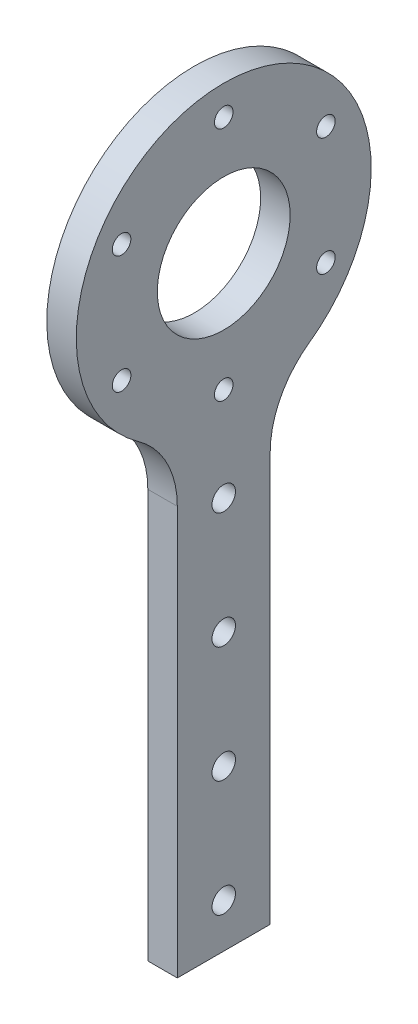
ISO-10303-21;
HEADER;
FILE_DESCRIPTION(('STEP AP214'),'2;1');
FILE_NAME('part.step','',(''),(''),'','','');
FILE_SCHEMA(('AUTOMOTIVE_DESIGN { 1 0 10303 214 1 1 1 1 }'));
ENDSEC;
DATA;
#1=APPLICATION_CONTEXT('core data for automotive mechanical design processes');
#2=APPLICATION_PROTOCOL_DEFINITION('international standard','automotive_design',2000,#1);
#3=PRODUCT_CONTEXT('',#1,'mechanical');
#4=PRODUCT('Part','Part','',(#3));
#5=PRODUCT_RELATED_PRODUCT_CATEGORY('part','',(#4));
#6=PRODUCT_DEFINITION_FORMATION('','',#4);
#7=PRODUCT_DEFINITION_CONTEXT('part definition',#1,'design');
#8=PRODUCT_DEFINITION('design','',#6,#7);
#9=PRODUCT_DEFINITION_SHAPE('','',#8);
#10=(LENGTH_UNIT() NAMED_UNIT(*) SI_UNIT(.MILLI.,.METRE.));
#11=(NAMED_UNIT(*) PLANE_ANGLE_UNIT() SI_UNIT($,.RADIAN.));
#12=(NAMED_UNIT(*) SI_UNIT($,.STERADIAN.) SOLID_ANGLE_UNIT());
#13=UNCERTAINTY_MEASURE_WITH_UNIT(LENGTH_MEASURE(1.E-05),#10,'distance_accuracy_value','');
#14=(GEOMETRIC_REPRESENTATION_CONTEXT(3) GLOBAL_UNCERTAINTY_ASSIGNED_CONTEXT((#13)) GLOBAL_UNIT_ASSIGNED_CONTEXT((#10,
#11,#12)) REPRESENTATION_CONTEXT('',''));
#15=CARTESIAN_POINT('',(0.,0.,0.));
#16=DIRECTION('',(0.,0.,1.));
#17=DIRECTION('',(1.,0.,0.));
#18=AXIS2_PLACEMENT_3D('',#15,#16,#17);
#19=CARTESIAN_POINT('',(6.35,0.,0.));
#20=DIRECTION('',(-1.,0.,0.));
#21=DIRECTION('',(0.,0.,1.));
#22=AXIS2_PLACEMENT_3D('',#19,#20,#21);
#23=CYLINDRICAL_SURFACE('',#22,31.75);
#24=CARTESIAN_POINT('',(6.35,0.,0.));
#25=DIRECTION('',(1.,0.,0.));
#26=DIRECTION('',(0.,0.,-1.));
#27=AXIS2_PLACEMENT_3D('',#24,#25,#26);
#28=CIRCLE('',#27,31.75);
#29=CARTESIAN_POINT('',(6.35,-25.8706229739502,-18.4057971014493));
#30=VERTEX_POINT('',#29);
#31=CARTESIAN_POINT('',(6.35,-25.8706229739502,18.4057971014493));
#32=VERTEX_POINT('',#31);
#33=EDGE_CURVE('E98',#30,#32,#28,.T.);
#34=ORIENTED_EDGE('',*,*,#33,.F.);
#35=DIRECTION('',(-1.,0.,0.));
#36=VECTOR('',#35,1.);
#37=CARTESIAN_POINT('',(6.35,-25.8706229739502,-18.4057971014493));
#38=LINE('',#37,#36);
#39=CARTESIAN_POINT('',(0.,-25.8706229739502,-18.4057971014493));
#40=VERTEX_POINT('',#39);
#41=EDGE_CURVE('E130',#30,#40,#38,.T.);
#42=ORIENTED_EDGE('',*,*,#41,.T.);
#43=CARTESIAN_POINT('',(0.,0.,0.));
#44=DIRECTION('',(1.,0.,0.));
#45=DIRECTION('',(0.,0.,-1.));
#46=AXIS2_PLACEMENT_3D('',#43,#44,#45);
#47=CIRCLE('',#46,31.75);
#48=CARTESIAN_POINT('',(0.,-25.8706229739502,18.4057971014493));
#49=VERTEX_POINT('',#48);
#50=EDGE_CURVE('E118',#40,#49,#47,.T.);
#51=ORIENTED_EDGE('',*,*,#50,.T.);
#52=DIRECTION('',(-1.,0.,0.));
#53=VECTOR('',#52,1.);
#54=CARTESIAN_POINT('',(6.35,-25.8706229739502,18.4057971014493));
#55=LINE('',#54,#53);
#56=EDGE_CURVE('E107',#49,#32,#55,.F.);
#57=ORIENTED_EDGE('',*,*,#56,.T.);
#58=EDGE_LOOP('',(#34,#42,#51,#57));
#59=FACE_BOUND('',#58,.T.);
#60=ADVANCED_FACE('F41',(#59),#23,.T.);
#61=CARTESIAN_POINT('',(6.35,0.,10.));
#62=DIRECTION('',(0.,0.,-1.));
#63=DIRECTION('',(0.,1.,0.));
#64=AXIS2_PLACEMENT_3D('',#61,#62,#63);
#65=PLANE('',#64);
#66=DIRECTION('',(0.,-1.,0.));
#67=VECTOR('',#66,1.);
#68=CARTESIAN_POINT('',(6.35,0.,10.));
#69=LINE('',#68,#67);
#70=CARTESIAN_POINT('',(6.35,-42.1670783906118,10.));
#71=VERTEX_POINT('',#70);
#72=CARTESIAN_POINT('',(6.35,-130.134075396468,9.99999999999999));
#73=VERTEX_POINT('',#72);
#74=EDGE_CURVE('E90',#71,#73,#69,.T.);
#75=ORIENTED_EDGE('',*,*,#74,.F.);
#76=DIRECTION('',(1.,0.,0.));
#77=VECTOR('',#76,1.);
#78=CARTESIAN_POINT('',(0.,-42.1670783906118,10.));
#79=LINE('',#78,#77);
#80=CARTESIAN_POINT('',(0.,-42.1670783906118,10.));
#81=VERTEX_POINT('',#80);
#82=EDGE_CURVE('E135',#71,#81,#79,.F.);
#83=ORIENTED_EDGE('',*,*,#82,.T.);
#84=DIRECTION('',(0.,-1.,0.));
#85=VECTOR('',#84,1.);
#86=CARTESIAN_POINT('',(0.,0.,10.));
#87=LINE('',#86,#85);
#88=CARTESIAN_POINT('',(0.,-130.134075396468,9.99999999999999));
#89=VERTEX_POINT('',#88);
#90=EDGE_CURVE('E104',#81,#89,#87,.T.);
#91=ORIENTED_EDGE('',*,*,#90,.T.);
#92=DIRECTION('',(-1.,0.,0.));
#93=VECTOR('',#92,1.);
#94=CARTESIAN_POINT('',(6.35,-130.134075396468,9.99999999999999));
#95=LINE('',#94,#93);
#96=EDGE_CURVE('E101',#73,#89,#95,.T.);
#97=ORIENTED_EDGE('',*,*,#96,.F.);
#98=EDGE_LOOP('',(#75,#83,#91,#97));
#99=FACE_BOUND('',#98,.T.);
#100=ADVANCED_FACE('F102',(#99),#65,.F.);
#101=CARTESIAN_POINT('',(6.35,-130.134075396468,0.));
#102=DIRECTION('',(0.,1.,0.));
#103=DIRECTION('',(0.,0.,1.));
#104=AXIS2_PLACEMENT_3D('',#101,#102,#103);
#105=PLANE('',#104);
#106=DIRECTION('',(0.,0.,-1.));
#107=VECTOR('',#106,1.);
#108=CARTESIAN_POINT('',(0.,-130.134075396468,0.));
#109=LINE('',#108,#107);
#110=CARTESIAN_POINT('',(0.,-130.134075396468,-9.99999999999999));
#111=VERTEX_POINT('',#110);
#112=EDGE_CURVE('E123',#89,#111,#109,.T.);
#113=ORIENTED_EDGE('',*,*,#112,.T.);
#114=DIRECTION('',(-1.,0.,0.));
#115=VECTOR('',#114,1.);
#116=CARTESIAN_POINT('',(6.35,-130.134075396468,-9.99999999999999));
#117=LINE('',#116,#115);
#118=CARTESIAN_POINT('',(6.35,-130.134075396468,-9.99999999999999));
#119=VERTEX_POINT('',#118);
#120=EDGE_CURVE('E108',#119,#111,#117,.T.);
#121=ORIENTED_EDGE('',*,*,#120,.F.);
#122=DIRECTION('',(0.,0.,-1.));
#123=VECTOR('',#122,1.);
#124=CARTESIAN_POINT('',(6.35,-130.134075396468,0.));
#125=LINE('',#124,#123);
#126=EDGE_CURVE('E95',#73,#119,#125,.T.);
#127=ORIENTED_EDGE('',*,*,#126,.F.);
#128=ORIENTED_EDGE('',*,*,#96,.T.);
#129=EDGE_LOOP('',(#113,#121,#127,#128));
#130=FACE_BOUND('',#129,.T.);
#131=ADVANCED_FACE('F110',(#130),#105,.F.);
#132=CARTESIAN_POINT('',(6.35,0.,-10.));
#133=DIRECTION('',(0.,0.,1.));
#134=DIRECTION('',(0.,-1.,0.));
#135=AXIS2_PLACEMENT_3D('',#132,#133,#134);
#136=PLANE('',#135);
#137=DIRECTION('',(0.,1.,0.));
#138=VECTOR('',#137,1.);
#139=CARTESIAN_POINT('',(0.,0.,-10.));
#140=LINE('',#139,#138);
#141=CARTESIAN_POINT('',(0.,-42.1670783906118,-10.));
#142=VERTEX_POINT('',#141);
#143=EDGE_CURVE('E125',#111,#142,#140,.T.);
#144=ORIENTED_EDGE('',*,*,#143,.T.);
#145=DIRECTION('',(1.,0.,0.));
#146=VECTOR('',#145,1.);
#147=CARTESIAN_POINT('',(6.35,-42.1670783906118,-10.));
#148=LINE('',#147,#146);
#149=CARTESIAN_POINT('',(6.35,-42.1670783906118,-10.));
#150=VERTEX_POINT('',#149);
#151=EDGE_CURVE('E133',#142,#150,#148,.T.);
#152=ORIENTED_EDGE('',*,*,#151,.T.);
#153=DIRECTION('',(0.,1.,0.));
#154=VECTOR('',#153,1.);
#155=CARTESIAN_POINT('',(6.35,0.,-10.));
#156=LINE('',#155,#154);
#157=EDGE_CURVE('E113',#119,#150,#156,.T.);
#158=ORIENTED_EDGE('',*,*,#157,.F.);
#159=ORIENTED_EDGE('',*,*,#120,.T.);
#160=EDGE_LOOP('',(#144,#152,#158,#159));
#161=FACE_BOUND('',#160,.T.);
#162=ADVANCED_FACE('F166',(#161),#136,.F.);
#163=CARTESIAN_POINT('',(6.35,0.,0.));
#164=DIRECTION('',(1.,0.,0.));
#165=DIRECTION('',(0.,0.,-1.));
#166=AXIS2_PLACEMENT_3D('',#163,#164,#165);
#167=PLANE('',#166);
#168=CARTESIAN_POINT('',(6.35,-120.636624279953,0.));
#169=DIRECTION('',(1.,0.,0.));
#170=DIRECTION('',(0.,0.,-1.));
#171=AXIS2_PLACEMENT_3D('',#168,#169,#170);
#172=CIRCLE('',#171,2.525);
#173=CARTESIAN_POINT('',(6.35,-120.636624279953,-2.525));
#174=VERTEX_POINT('',#173);
#175=EDGE_CURVE('E222',#174,#174,#172,.T.);
#176=ORIENTED_EDGE('',*,*,#175,.F.);
#177=EDGE_LOOP('',(#176));
#178=FACE_BOUND('',#177,.T.);
#179=CARTESIAN_POINT('',(6.35,-95.6366242799533,0.));
#180=DIRECTION('',(1.,0.,0.));
#181=DIRECTION('',(0.,0.,-1.));
#182=AXIS2_PLACEMENT_3D('',#179,#180,#181);
#183=CIRCLE('',#182,2.525);
#184=CARTESIAN_POINT('',(6.35,-95.6366242799533,-2.525));
#185=VERTEX_POINT('',#184);
#186=EDGE_CURVE('E223',#185,#185,#183,.T.);
#187=ORIENTED_EDGE('',*,*,#186,.F.);
#188=EDGE_LOOP('',(#187));
#189=FACE_BOUND('',#188,.T.);
#190=CARTESIAN_POINT('',(6.35,-70.6366242799533,0.));
#191=DIRECTION('',(1.,0.,0.));
#192=DIRECTION('',(0.,0.,-1.));
#193=AXIS2_PLACEMENT_3D('',#190,#191,#192);
#194=CIRCLE('',#193,2.525);
#195=CARTESIAN_POINT('',(6.35,-70.6366242799533,-2.525));
#196=VERTEX_POINT('',#195);
#197=EDGE_CURVE('E233',#196,#196,#194,.T.);
#198=ORIENTED_EDGE('',*,*,#197,.F.);
#199=EDGE_LOOP('',(#198));
#200=FACE_BOUND('',#199,.T.);
#201=CARTESIAN_POINT('',(6.35,-45.6366242799533,0.));
#202=DIRECTION('',(1.,0.,0.));
#203=DIRECTION('',(0.,0.,-1.));
#204=AXIS2_PLACEMENT_3D('',#201,#202,#203);
#205=CIRCLE('',#204,2.525);
#206=CARTESIAN_POINT('',(6.35,-45.6366242799533,-2.525));
#207=VERTEX_POINT('',#206);
#208=EDGE_CURVE('E239',#207,#207,#205,.T.);
#209=ORIENTED_EDGE('',*,*,#208,.F.);
#210=EDGE_LOOP('',(#209));
#211=FACE_BOUND('',#210,.T.);
#212=CARTESIAN_POINT('',(6.35,12.7000000000003,21.9970452561246));
#213=DIRECTION('',(1.,0.,0.));
#214=DIRECTION('',(0.,0.,-1.));
#215=AXIS2_PLACEMENT_3D('',#212,#213,#214);
#216=CIRCLE('',#215,2.);
#217=CARTESIAN_POINT('',(6.35,12.7000000000003,19.9970452561246));
#218=VERTEX_POINT('',#217);
#219=EDGE_CURVE('E276',#218,#218,#216,.T.);
#220=ORIENTED_EDGE('',*,*,#219,.F.);
#221=EDGE_LOOP('',(#220));
#222=FACE_BOUND('',#221,.T.);
#223=CARTESIAN_POINT('',(6.35,-12.6999999999998,21.9970452561249));
#224=DIRECTION('',(1.,0.,0.));
#225=DIRECTION('',(0.,0.,-1.));
#226=AXIS2_PLACEMENT_3D('',#223,#224,#225);
#227=CIRCLE('',#226,2.);
#228=CARTESIAN_POINT('',(6.35,-12.6999999999998,19.9970452561249));
#229=VERTEX_POINT('',#228);
#230=EDGE_CURVE('E270',#229,#229,#227,.T.);
#231=ORIENTED_EDGE('',*,*,#230,.F.);
#232=EDGE_LOOP('',(#231));
#233=FACE_BOUND('',#232,.T.);
#234=CARTESIAN_POINT('',(6.35,-25.4,1.77367252013231E-13));
#235=DIRECTION('',(1.,0.,0.));
#236=DIRECTION('',(0.,0.,-1.));
#237=AXIS2_PLACEMENT_3D('',#234,#235,#236);
#238=CIRCLE('',#237,2.);
#239=CARTESIAN_POINT('',(6.35,-25.4,-1.99999999999982));
#240=VERTEX_POINT('',#239);
#241=EDGE_CURVE('E264',#240,#240,#238,.T.);
#242=ORIENTED_EDGE('',*,*,#241,.F.);
#243=EDGE_LOOP('',(#242));
#244=FACE_BOUND('',#243,.T.);
#245=CARTESIAN_POINT('',(6.35,-12.7000000000001,-21.9970452561247));
#246=DIRECTION('',(1.,0.,0.));
#247=DIRECTION('',(0.,0.,-1.));
#248=AXIS2_PLACEMENT_3D('',#245,#246,#247);
#249=CIRCLE('',#248,2.);
#250=CARTESIAN_POINT('',(6.35,-12.7000000000001,-23.9970452561247));
#251=VERTEX_POINT('',#250);
#252=EDGE_CURVE('E258',#251,#251,#249,.T.);
#253=ORIENTED_EDGE('',*,*,#252,.F.);
#254=EDGE_LOOP('',(#253));
#255=FACE_BOUND('',#254,.T.);
#256=CARTESIAN_POINT('',(6.35,12.6999999999999,-21.9970452561248));
#257=DIRECTION('',(1.,0.,0.));
#258=DIRECTION('',(0.,0.,-1.));
#259=AXIS2_PLACEMENT_3D('',#256,#257,#258);
#260=CIRCLE('',#259,2.);
#261=CARTESIAN_POINT('',(6.35,12.6999999999999,-23.9970452561248));
#262=VERTEX_POINT('',#261);
#263=EDGE_CURVE('E252',#262,#262,#260,.T.);
#264=ORIENTED_EDGE('',*,*,#263,.F.);
#265=EDGE_LOOP('',(#264));
#266=FACE_BOUND('',#265,.T.);
#267=CARTESIAN_POINT('',(6.35,25.4,0.));
#268=DIRECTION('',(1.,0.,0.));
#269=DIRECTION('',(0.,0.,-1.));
#270=AXIS2_PLACEMENT_3D('',#267,#268,#269);
#271=CIRCLE('',#270,2.);
#272=CARTESIAN_POINT('',(6.35,25.4,-2.));
#273=VERTEX_POINT('',#272);
#274=EDGE_CURVE('E245',#273,#273,#271,.T.);
#275=ORIENTED_EDGE('',*,*,#274,.F.);
#276=EDGE_LOOP('',(#275));
#277=FACE_BOUND('',#276,.T.);
#278=CARTESIAN_POINT('',(6.35,0.,0.));
#279=DIRECTION('',(1.,0.,0.));
#280=DIRECTION('',(0.,0.,-1.));
#281=AXIS2_PLACEMENT_3D('',#278,#279,#280);
#282=CIRCLE('',#281,14.3);
#283=CARTESIAN_POINT('',(6.35,0.,-14.3));
#284=VERTEX_POINT('',#283);
#285=EDGE_CURVE('E248',#284,#284,#282,.T.);
#286=ORIENTED_EDGE('',*,*,#285,.F.);
#287=EDGE_LOOP('',(#286));
#288=FACE_BOUND('',#287,.T.);
#289=ORIENTED_EDGE('',*,*,#157,.T.);
#290=CARTESIAN_POINT('',(6.35,-42.1670783906118,-30.));
#291=DIRECTION('',(1.,0.,0.));
#292=DIRECTION('',(0.,0.,-1.));
#293=AXIS2_PLACEMENT_3D('',#290,#291,#292);
#294=CIRCLE('',#293,20.);
#295=EDGE_CURVE('E139',#150,#30,#294,.F.);
#296=ORIENTED_EDGE('',*,*,#295,.T.);
#297=ORIENTED_EDGE('',*,*,#33,.T.);
#298=CARTESIAN_POINT('',(6.35,-42.1670783906118,30.));
#299=DIRECTION('',(1.,0.,0.));
#300=DIRECTION('',(0.,0.,-1.));
#301=AXIS2_PLACEMENT_3D('',#298,#299,#300);
#302=CIRCLE('',#301,20.);
#303=EDGE_CURVE('E11',#32,#71,#302,.F.);
#304=ORIENTED_EDGE('',*,*,#303,.T.);
#305=ORIENTED_EDGE('',*,*,#74,.T.);
#306=ORIENTED_EDGE('',*,*,#126,.T.);
#307=EDGE_LOOP('',(#289,#296,#297,#304,#305,#306));
#308=FACE_BOUND('',#307,.T.);
#309=ADVANCED_FACE('F93',(#178,#189,#200,#211,#222,#233,#244,#255,#266,#277,#288,#308),#167,.T.);
#310=CARTESIAN_POINT('',(0.,0.,0.));
#311=DIRECTION('',(1.,0.,0.));
#312=DIRECTION('',(0.,0.,-1.));
#313=AXIS2_PLACEMENT_3D('',#310,#311,#312);
#314=PLANE('',#313);
#315=CARTESIAN_POINT('',(0.,-120.636624279953,0.));
#316=DIRECTION('',(1.,0.,0.));
#317=DIRECTION('',(0.,0.,-1.));
#318=AXIS2_PLACEMENT_3D('',#315,#316,#317);
#319=CIRCLE('',#318,2.525);
#320=CARTESIAN_POINT('',(0.,-120.636624279953,-2.525));
#321=VERTEX_POINT('',#320);
#322=EDGE_CURVE('E219',#321,#321,#319,.T.);
#323=ORIENTED_EDGE('',*,*,#322,.T.);
#324=EDGE_LOOP('',(#323));
#325=FACE_BOUND('',#324,.T.);
#326=CARTESIAN_POINT('',(0.,-95.6366242799533,0.));
#327=DIRECTION('',(1.,0.,0.));
#328=DIRECTION('',(0.,0.,-1.));
#329=AXIS2_PLACEMENT_3D('',#326,#327,#328);
#330=CIRCLE('',#329,2.525);
#331=CARTESIAN_POINT('',(0.,-95.6366242799533,-2.525));
#332=VERTEX_POINT('',#331);
#333=EDGE_CURVE('E228',#332,#332,#330,.T.);
#334=ORIENTED_EDGE('',*,*,#333,.T.);
#335=EDGE_LOOP('',(#334));
#336=FACE_BOUND('',#335,.T.);
#337=CARTESIAN_POINT('',(0.,-70.6366242799533,0.));
#338=DIRECTION('',(1.,0.,0.));
#339=DIRECTION('',(0.,0.,-1.));
#340=AXIS2_PLACEMENT_3D('',#337,#338,#339);
#341=CIRCLE('',#340,2.525);
#342=CARTESIAN_POINT('',(0.,-70.6366242799533,-2.525));
#343=VERTEX_POINT('',#342);
#344=EDGE_CURVE('E236',#343,#343,#341,.T.);
#345=ORIENTED_EDGE('',*,*,#344,.T.);
#346=EDGE_LOOP('',(#345));
#347=FACE_BOUND('',#346,.T.);
#348=CARTESIAN_POINT('',(0.,-45.6366242799533,0.));
#349=DIRECTION('',(1.,0.,0.));
#350=DIRECTION('',(0.,0.,-1.));
#351=AXIS2_PLACEMENT_3D('',#348,#349,#350);
#352=CIRCLE('',#351,2.525);
#353=CARTESIAN_POINT('',(0.,-45.6366242799533,-2.525));
#354=VERTEX_POINT('',#353);
#355=EDGE_CURVE('E242',#354,#354,#352,.T.);
#356=ORIENTED_EDGE('',*,*,#355,.T.);
#357=EDGE_LOOP('',(#356));
#358=FACE_BOUND('',#357,.T.);
#359=CARTESIAN_POINT('',(0.,12.7000000000003,21.9970452561246));
#360=DIRECTION('',(1.,0.,0.));
#361=DIRECTION('',(0.,0.,-1.));
#362=AXIS2_PLACEMENT_3D('',#359,#360,#361);
#363=CIRCLE('',#362,2.);
#364=CARTESIAN_POINT('',(0.,12.7000000000003,19.9970452561246));
#365=VERTEX_POINT('',#364);
#366=EDGE_CURVE('E225',#365,#365,#363,.T.);
#367=ORIENTED_EDGE('',*,*,#366,.T.);
#368=EDGE_LOOP('',(#367));
#369=FACE_BOUND('',#368,.T.);
#370=CARTESIAN_POINT('',(0.,-12.6999999999998,21.9970452561249));
#371=DIRECTION('',(1.,0.,0.));
#372=DIRECTION('',(0.,0.,-1.));
#373=AXIS2_PLACEMENT_3D('',#370,#371,#372);
#374=CIRCLE('',#373,2.);
#375=CARTESIAN_POINT('',(0.,-12.6999999999998,19.9970452561249));
#376=VERTEX_POINT('',#375);
#377=EDGE_CURVE('E273',#376,#376,#374,.T.);
#378=ORIENTED_EDGE('',*,*,#377,.T.);
#379=EDGE_LOOP('',(#378));
#380=FACE_BOUND('',#379,.T.);
#381=CARTESIAN_POINT('',(0.,-25.4,1.77367252013231E-13));
#382=DIRECTION('',(1.,0.,0.));
#383=DIRECTION('',(0.,0.,-1.));
#384=AXIS2_PLACEMENT_3D('',#381,#382,#383);
#385=CIRCLE('',#384,2.);
#386=CARTESIAN_POINT('',(0.,-25.4,-1.99999999999982));
#387=VERTEX_POINT('',#386);
#388=EDGE_CURVE('E267',#387,#387,#385,.T.);
#389=ORIENTED_EDGE('',*,*,#388,.T.);
#390=EDGE_LOOP('',(#389));
#391=FACE_BOUND('',#390,.T.);
#392=CARTESIAN_POINT('',(0.,-12.7000000000001,-21.9970452561247));
#393=DIRECTION('',(1.,0.,0.));
#394=DIRECTION('',(0.,0.,-1.));
#395=AXIS2_PLACEMENT_3D('',#392,#393,#394);
#396=CIRCLE('',#395,2.);
#397=CARTESIAN_POINT('',(0.,-12.7000000000001,-23.9970452561247));
#398=VERTEX_POINT('',#397);
#399=EDGE_CURVE('E261',#398,#398,#396,.T.);
#400=ORIENTED_EDGE('',*,*,#399,.T.);
#401=EDGE_LOOP('',(#400));
#402=FACE_BOUND('',#401,.T.);
#403=CARTESIAN_POINT('',(0.,12.6999999999999,-21.9970452561248));
#404=DIRECTION('',(1.,0.,0.));
#405=DIRECTION('',(0.,0.,-1.));
#406=AXIS2_PLACEMENT_3D('',#403,#404,#405);
#407=CIRCLE('',#406,2.);
#408=CARTESIAN_POINT('',(0.,12.6999999999999,-23.9970452561248));
#409=VERTEX_POINT('',#408);
#410=EDGE_CURVE('E255',#409,#409,#407,.T.);
#411=ORIENTED_EDGE('',*,*,#410,.T.);
#412=EDGE_LOOP('',(#411));
#413=FACE_BOUND('',#412,.T.);
#414=CARTESIAN_POINT('',(0.,25.4,0.));
#415=DIRECTION('',(1.,0.,0.));
#416=DIRECTION('',(0.,0.,-1.));
#417=AXIS2_PLACEMENT_3D('',#414,#415,#416);
#418=CIRCLE('',#417,2.);
#419=CARTESIAN_POINT('',(0.,25.4,-2.));
#420=VERTEX_POINT('',#419);
#421=EDGE_CURVE('E249',#420,#420,#418,.T.);
#422=ORIENTED_EDGE('',*,*,#421,.T.);
#423=EDGE_LOOP('',(#422));
#424=FACE_BOUND('',#423,.T.);
#425=CARTESIAN_POINT('',(0.,0.,0.));
#426=DIRECTION('',(1.,0.,0.));
#427=DIRECTION('',(0.,0.,-1.));
#428=AXIS2_PLACEMENT_3D('',#425,#426,#427);
#429=CIRCLE('',#428,14.3);
#430=CARTESIAN_POINT('',(0.,0.,-14.3));
#431=VERTEX_POINT('',#430);
#432=EDGE_CURVE('E121',#431,#431,#429,.T.);
#433=ORIENTED_EDGE('',*,*,#432,.T.);
#434=EDGE_LOOP('',(#433));
#435=FACE_BOUND('',#434,.T.);
#436=ORIENTED_EDGE('',*,*,#50,.F.);
#437=CARTESIAN_POINT('',(0.,-42.1670783906118,-30.));
#438=DIRECTION('',(1.,0.,0.));
#439=DIRECTION('',(0.,0.,-1.));
#440=AXIS2_PLACEMENT_3D('',#437,#438,#439);
#441=CIRCLE('',#440,20.);
#442=EDGE_CURVE('E137',#40,#142,#441,.T.);
#443=ORIENTED_EDGE('',*,*,#442,.T.);
#444=ORIENTED_EDGE('',*,*,#143,.F.);
#445=ORIENTED_EDGE('',*,*,#112,.F.);
#446=ORIENTED_EDGE('',*,*,#90,.F.);
#447=CARTESIAN_POINT('',(0.,-42.1670783906118,30.));
#448=DIRECTION('',(1.,0.,0.));
#449=DIRECTION('',(0.,0.,-1.));
#450=AXIS2_PLACEMENT_3D('',#447,#448,#449);
#451=CIRCLE('',#450,20.);
#452=EDGE_CURVE('E49',#81,#49,#451,.T.);
#453=ORIENTED_EDGE('',*,*,#452,.T.);
#454=EDGE_LOOP('',(#436,#443,#444,#445,#446,#453));
#455=FACE_BOUND('',#454,.T.);
#456=ADVANCED_FACE('F142',(#325,#336,#347,#358,#369,#380,#391,#402,#413,#424,#435,#455),#314,.F.);
#457=CARTESIAN_POINT('',(6.35,-42.1670783906118,-30.));
#458=DIRECTION('',(-1.,0.,0.));
#459=DIRECTION('',(0.,0.,1.));
#460=AXIS2_PLACEMENT_3D('',#457,#458,#459);
#461=CYLINDRICAL_SURFACE('',#460,20.);
#462=ORIENTED_EDGE('',*,*,#295,.F.);
#463=ORIENTED_EDGE('',*,*,#151,.F.);
#464=ORIENTED_EDGE('',*,*,#442,.F.);
#465=ORIENTED_EDGE('',*,*,#41,.F.);
#466=EDGE_LOOP('',(#462,#463,#464,#465));
#467=FACE_BOUND('',#466,.T.);
#468=ADVANCED_FACE('F148',(#467),#461,.F.);
#469=CARTESIAN_POINT('',(6.35,-42.1670783906118,30.));
#470=DIRECTION('',(-1.,0.,0.));
#471=DIRECTION('',(0.,0.,1.));
#472=AXIS2_PLACEMENT_3D('',#469,#470,#471);
#473=CYLINDRICAL_SURFACE('',#472,20.);
#474=ORIENTED_EDGE('',*,*,#303,.F.);
#475=ORIENTED_EDGE('',*,*,#56,.F.);
#476=ORIENTED_EDGE('',*,*,#452,.F.);
#477=ORIENTED_EDGE('',*,*,#82,.F.);
#478=EDGE_LOOP('',(#474,#475,#476,#477));
#479=FACE_BOUND('',#478,.T.);
#480=ADVANCED_FACE('F43',(#479),#473,.F.);
#481=CARTESIAN_POINT('',(0.,0.,0.));
#482=DIRECTION('',(1.,0.,0.));
#483=DIRECTION('',(0.,0.,-1.));
#484=AXIS2_PLACEMENT_3D('',#481,#482,#483);
#485=CYLINDRICAL_SURFACE('',#484,14.3);
#486=ORIENTED_EDGE('',*,*,#432,.F.);
#487=EDGE_LOOP('',(#486));
#488=FACE_BOUND('',#487,.T.);
#489=ORIENTED_EDGE('',*,*,#285,.T.);
#490=EDGE_LOOP('',(#489));
#491=FACE_BOUND('',#490,.T.);
#492=ADVANCED_FACE('F147',(#488,#491),#485,.F.);
#493=CARTESIAN_POINT('',(0.,25.4,0.));
#494=DIRECTION('',(1.,0.,0.));
#495=DIRECTION('',(0.,0.,-1.));
#496=AXIS2_PLACEMENT_3D('',#493,#494,#495);
#497=CYLINDRICAL_SURFACE('',#496,2.);
#498=ORIENTED_EDGE('',*,*,#421,.F.);
#499=EDGE_LOOP('',(#498));
#500=FACE_BOUND('',#499,.T.);
#501=ORIENTED_EDGE('',*,*,#274,.T.);
#502=EDGE_LOOP('',(#501));
#503=FACE_BOUND('',#502,.T.);
#504=ADVANCED_FACE('F153',(#500,#503),#497,.F.);
#505=CARTESIAN_POINT('',(0.,12.6999999999999,-21.9970452561248));
#506=DIRECTION('',(1.,0.,0.));
#507=DIRECTION('',(0.,0.,-1.));
#508=AXIS2_PLACEMENT_3D('',#505,#506,#507);
#509=CYLINDRICAL_SURFACE('',#508,2.);
#510=ORIENTED_EDGE('',*,*,#410,.F.);
#511=EDGE_LOOP('',(#510));
#512=FACE_BOUND('',#511,.T.);
#513=ORIENTED_EDGE('',*,*,#263,.T.);
#514=EDGE_LOOP('',(#513));
#515=FACE_BOUND('',#514,.T.);
#516=ADVANCED_FACE('F192',(#512,#515),#509,.F.);
#517=CARTESIAN_POINT('',(0.,-12.7000000000001,-21.9970452561247));
#518=DIRECTION('',(1.,0.,0.));
#519=DIRECTION('',(0.,0.,-1.));
#520=AXIS2_PLACEMENT_3D('',#517,#518,#519);
#521=CYLINDRICAL_SURFACE('',#520,2.);
#522=ORIENTED_EDGE('',*,*,#399,.F.);
#523=EDGE_LOOP('',(#522));
#524=FACE_BOUND('',#523,.T.);
#525=ORIENTED_EDGE('',*,*,#252,.T.);
#526=EDGE_LOOP('',(#525));
#527=FACE_BOUND('',#526,.T.);
#528=ADVANCED_FACE('F188',(#524,#527),#521,.F.);
#529=CARTESIAN_POINT('',(0.,-25.4,1.77367252013231E-13));
#530=DIRECTION('',(1.,0.,0.));
#531=DIRECTION('',(0.,0.,-1.));
#532=AXIS2_PLACEMENT_3D('',#529,#530,#531);
#533=CYLINDRICAL_SURFACE('',#532,2.);
#534=ORIENTED_EDGE('',*,*,#388,.F.);
#535=EDGE_LOOP('',(#534));
#536=FACE_BOUND('',#535,.T.);
#537=ORIENTED_EDGE('',*,*,#241,.T.);
#538=EDGE_LOOP('',(#537));
#539=FACE_BOUND('',#538,.T.);
#540=ADVANCED_FACE('F184',(#536,#539),#533,.F.);
#541=CARTESIAN_POINT('',(0.,-12.6999999999998,21.9970452561249));
#542=DIRECTION('',(1.,0.,0.));
#543=DIRECTION('',(0.,0.,-1.));
#544=AXIS2_PLACEMENT_3D('',#541,#542,#543);
#545=CYLINDRICAL_SURFACE('',#544,2.);
#546=ORIENTED_EDGE('',*,*,#377,.F.);
#547=EDGE_LOOP('',(#546));
#548=FACE_BOUND('',#547,.T.);
#549=ORIENTED_EDGE('',*,*,#230,.T.);
#550=EDGE_LOOP('',(#549));
#551=FACE_BOUND('',#550,.T.);
#552=ADVANCED_FACE('F180',(#548,#551),#545,.F.);
#553=CARTESIAN_POINT('',(0.,12.7000000000003,21.9970452561246));
#554=DIRECTION('',(1.,0.,0.));
#555=DIRECTION('',(0.,0.,-1.));
#556=AXIS2_PLACEMENT_3D('',#553,#554,#555);
#557=CYLINDRICAL_SURFACE('',#556,2.);
#558=ORIENTED_EDGE('',*,*,#366,.F.);
#559=EDGE_LOOP('',(#558));
#560=FACE_BOUND('',#559,.T.);
#561=ORIENTED_EDGE('',*,*,#219,.T.);
#562=EDGE_LOOP('',(#561));
#563=FACE_BOUND('',#562,.T.);
#564=ADVANCED_FACE('F176',(#560,#563),#557,.F.);
#565=CARTESIAN_POINT('',(0.,-45.6366242799533,0.));
#566=DIRECTION('',(1.,0.,0.));
#567=DIRECTION('',(0.,0.,-1.));
#568=AXIS2_PLACEMENT_3D('',#565,#566,#567);
#569=CYLINDRICAL_SURFACE('',#568,2.525);
#570=ORIENTED_EDGE('',*,*,#355,.F.);
#571=EDGE_LOOP('',(#570));
#572=FACE_BOUND('',#571,.T.);
#573=ORIENTED_EDGE('',*,*,#208,.T.);
#574=EDGE_LOOP('',(#573));
#575=FACE_BOUND('',#574,.T.);
#576=ADVANCED_FACE('F179',(#572,#575),#569,.F.);
#577=CARTESIAN_POINT('',(0.,-70.6366242799533,0.));
#578=DIRECTION('',(1.,0.,0.));
#579=DIRECTION('',(0.,0.,-1.));
#580=AXIS2_PLACEMENT_3D('',#577,#578,#579);
#581=CYLINDRICAL_SURFACE('',#580,2.525);
#582=ORIENTED_EDGE('',*,*,#344,.F.);
#583=EDGE_LOOP('',(#582));
#584=FACE_BOUND('',#583,.T.);
#585=ORIENTED_EDGE('',*,*,#197,.T.);
#586=EDGE_LOOP('',(#585));
#587=FACE_BOUND('',#586,.T.);
#588=ADVANCED_FACE('F202',(#584,#587),#581,.F.);
#589=CARTESIAN_POINT('',(0.,-95.6366242799533,0.));
#590=DIRECTION('',(1.,0.,0.));
#591=DIRECTION('',(0.,0.,-1.));
#592=AXIS2_PLACEMENT_3D('',#589,#590,#591);
#593=CYLINDRICAL_SURFACE('',#592,2.525);
#594=ORIENTED_EDGE('',*,*,#333,.F.);
#595=EDGE_LOOP('',(#594));
#596=FACE_BOUND('',#595,.T.);
#597=ORIENTED_EDGE('',*,*,#186,.T.);
#598=EDGE_LOOP('',(#597));
#599=FACE_BOUND('',#598,.T.);
#600=ADVANCED_FACE('F206',(#596,#599),#593,.F.);
#601=CARTESIAN_POINT('',(0.,-120.636624279953,0.));
#602=DIRECTION('',(1.,0.,0.));
#603=DIRECTION('',(0.,0.,-1.));
#604=AXIS2_PLACEMENT_3D('',#601,#602,#603);
#605=CYLINDRICAL_SURFACE('',#604,2.525);
#606=ORIENTED_EDGE('',*,*,#322,.F.);
#607=EDGE_LOOP('',(#606));
#608=FACE_BOUND('',#607,.T.);
#609=ORIENTED_EDGE('',*,*,#175,.T.);
#610=EDGE_LOOP('',(#609));
#611=FACE_BOUND('',#610,.T.);
#612=ADVANCED_FACE('F210',(#608,#611),#605,.F.);
#613=CLOSED_SHELL('',(#60,#100,#131,#162,#309,#456,#468,#480,#492,#504,#516,#528,#540,#552,#564,
#576,#588,#600,#612));
#614=MANIFOLD_SOLID_BREP('B2',#613);
#615=ADVANCED_BREP_SHAPE_REPRESENTATION('',(#18,#614),#14);
#616=SHAPE_DEFINITION_REPRESENTATION(#9,#615);
ENDSEC;
END-ISO-10303-21;
